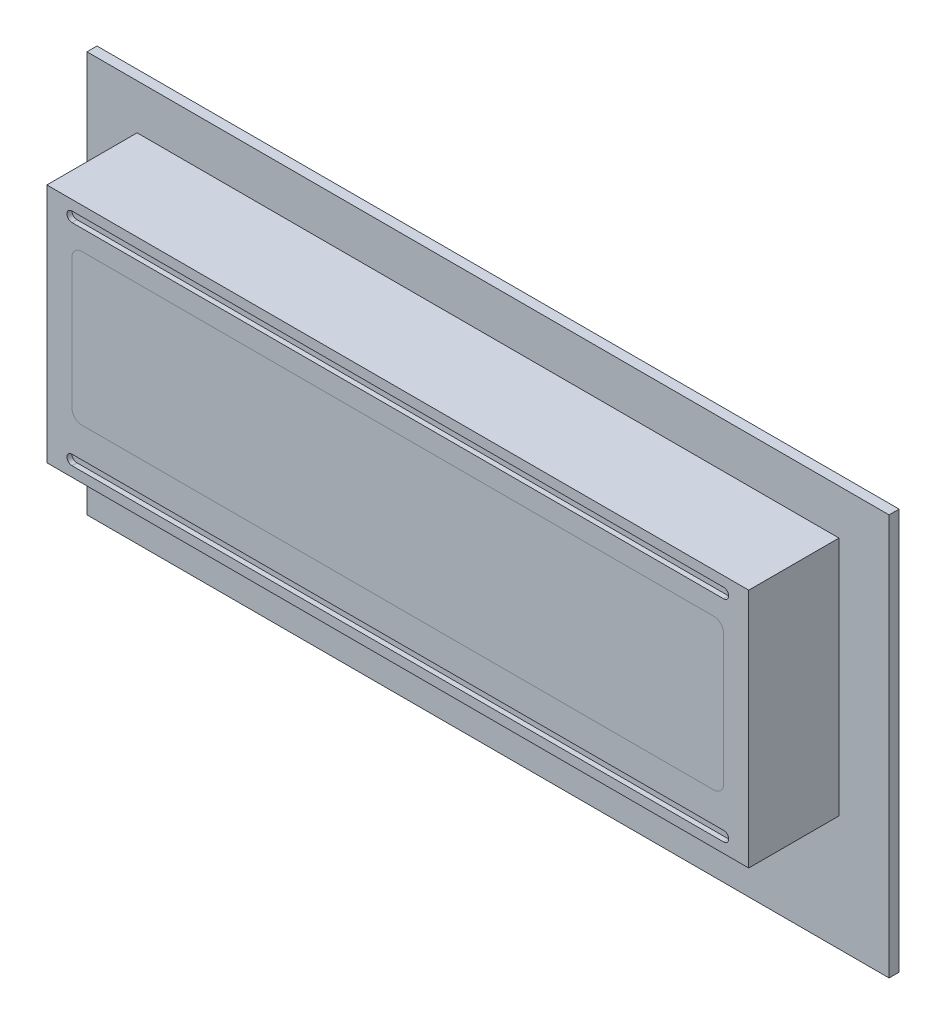
ISO-10303-21;
HEADER;
FILE_DESCRIPTION(('STEP AP214'),'2;1');
FILE_NAME('part.step','',(''),(''),'','','');
FILE_SCHEMA(('AUTOMOTIVE_DESIGN { 1 0 10303 214 1 1 1 1 }'));
ENDSEC;
DATA;
#1=APPLICATION_CONTEXT('core data for automotive mechanical design processes');
#2=APPLICATION_PROTOCOL_DEFINITION('international standard','automotive_design',2000,#1);
#3=PRODUCT_CONTEXT('',#1,'mechanical');
#4=PRODUCT('Part','Part','',(#3));
#5=PRODUCT_RELATED_PRODUCT_CATEGORY('part','',(#4));
#6=PRODUCT_DEFINITION_FORMATION('','',#4);
#7=PRODUCT_DEFINITION_CONTEXT('part definition',#1,'design');
#8=PRODUCT_DEFINITION('design','',#6,#7);
#9=PRODUCT_DEFINITION_SHAPE('','',#8);
#10=(LENGTH_UNIT() NAMED_UNIT(*) SI_UNIT(.MILLI.,.METRE.));
#11=(NAMED_UNIT(*) PLANE_ANGLE_UNIT() SI_UNIT($,.RADIAN.));
#12=(NAMED_UNIT(*) SI_UNIT($,.STERADIAN.) SOLID_ANGLE_UNIT());
#13=UNCERTAINTY_MEASURE_WITH_UNIT(LENGTH_MEASURE(1.E-05),#10,'distance_accuracy_value','');
#14=(GEOMETRIC_REPRESENTATION_CONTEXT(3) GLOBAL_UNCERTAINTY_ASSIGNED_CONTEXT((#13)) GLOBAL_UNIT_ASSIGNED_CONTEXT((#10,
#11,#12)) REPRESENTATION_CONTEXT('',''));
#15=CARTESIAN_POINT('',(0.,0.,0.));
#16=DIRECTION('',(0.,0.,1.));
#17=DIRECTION('',(1.,0.,0.));
#18=AXIS2_PLACEMENT_3D('',#15,#16,#17);
#19=CARTESIAN_POINT('',(-31.5,10.5,9.));
#20=DIRECTION('',(0.,0.,1.));
#21=DIRECTION('',(1.,0.,0.));
#22=AXIS2_PLACEMENT_3D('',#19,#20,#21);
#23=CYLINDRICAL_SURFACE('',#22,1.);
#24=CARTESIAN_POINT('',(-31.5,10.5,10.));
#25=DIRECTION('',(0.,0.,1.));
#26=DIRECTION('',(1.,0.,0.));
#27=AXIS2_PLACEMENT_3D('',#24,#25,#26);
#28=CIRCLE('',#27,1.);
#29=CARTESIAN_POINT('',(-31.5,11.5,10.));
#30=VERTEX_POINT('',#29);
#31=CARTESIAN_POINT('',(-32.5,10.5,10.));
#32=VERTEX_POINT('',#31);
#33=EDGE_CURVE('E141',#30,#32,#28,.T.);
#34=ORIENTED_EDGE('',*,*,#33,.F.);
#35=DIRECTION('',(0.,0.,1.));
#36=VECTOR('',#35,1.);
#37=CARTESIAN_POINT('',(-31.5,11.5,9.));
#38=LINE('',#37,#36);
#39=CARTESIAN_POINT('',(-31.5,11.5,9.));
#40=VERTEX_POINT('',#39);
#41=EDGE_CURVE('E12',#40,#30,#38,.T.);
#42=ORIENTED_EDGE('',*,*,#41,.F.);
#43=CARTESIAN_POINT('',(-31.5,10.5,9.));
#44=DIRECTION('',(0.,0.,1.));
#45=DIRECTION('',(1.,0.,0.));
#46=AXIS2_PLACEMENT_3D('',#43,#44,#45);
#47=CIRCLE('',#46,1.);
#48=CARTESIAN_POINT('',(-32.5,10.5,9.));
#49=VERTEX_POINT('',#48);
#50=EDGE_CURVE('E161',#40,#49,#47,.T.);
#51=ORIENTED_EDGE('',*,*,#50,.T.);
#52=DIRECTION('',(0.,0.,1.));
#53=VECTOR('',#52,1.);
#54=CARTESIAN_POINT('',(-32.5,10.5,9.));
#55=LINE('',#54,#53);
#56=EDGE_CURVE('E47',#49,#32,#55,.T.);
#57=ORIENTED_EDGE('',*,*,#56,.T.);
#58=EDGE_LOOP('',(#34,#42,#51,#57));
#59=FACE_BOUND('',#58,.T.);
#60=ADVANCED_FACE('F44',(#59),#23,.T.);
#61=CARTESIAN_POINT('',(31.5,11.5,9.));
#62=DIRECTION('',(0.,1.,0.));
#63=DIRECTION('',(0.,0.,1.));
#64=AXIS2_PLACEMENT_3D('',#61,#62,#63);
#65=PLANE('',#64);
#66=DIRECTION('',(-1.,0.,0.));
#67=VECTOR('',#66,1.);
#68=CARTESIAN_POINT('',(31.5,11.5,10.));
#69=LINE('',#68,#67);
#70=CARTESIAN_POINT('',(31.5,11.5,10.));
#71=VERTEX_POINT('',#70);
#72=EDGE_CURVE('E159',#71,#30,#69,.T.);
#73=ORIENTED_EDGE('',*,*,#72,.F.);
#74=DIRECTION('',(0.,0.,1.));
#75=VECTOR('',#74,1.);
#76=CARTESIAN_POINT('',(31.5,11.5,9.));
#77=LINE('',#76,#75);
#78=CARTESIAN_POINT('',(31.5,11.5,9.));
#79=VERTEX_POINT('',#78);
#80=EDGE_CURVE('E53',#79,#71,#77,.T.);
#81=ORIENTED_EDGE('',*,*,#80,.F.);
#82=DIRECTION('',(-1.,0.,0.));
#83=VECTOR('',#82,1.);
#84=CARTESIAN_POINT('',(31.5,11.5,9.));
#85=LINE('',#84,#83);
#86=EDGE_CURVE('E131',#79,#40,#85,.T.);
#87=ORIENTED_EDGE('',*,*,#86,.T.);
#88=ORIENTED_EDGE('',*,*,#41,.T.);
#89=EDGE_LOOP('',(#73,#81,#87,#88));
#90=FACE_BOUND('',#89,.T.);
#91=ADVANCED_FACE('F173',(#90),#65,.T.);
#92=CARTESIAN_POINT('',(31.5,10.5,9.));
#93=DIRECTION('',(0.,0.,1.));
#94=DIRECTION('',(1.,0.,0.));
#95=AXIS2_PLACEMENT_3D('',#92,#93,#94);
#96=CYLINDRICAL_SURFACE('',#95,1.);
#97=CARTESIAN_POINT('',(31.5,10.5,10.));
#98=DIRECTION('',(0.,0.,1.));
#99=DIRECTION('',(1.,0.,0.));
#100=AXIS2_PLACEMENT_3D('',#97,#98,#99);
#101=CIRCLE('',#100,1.);
#102=CARTESIAN_POINT('',(32.5,10.5,10.));
#103=VERTEX_POINT('',#102);
#104=EDGE_CURVE('E118',#103,#71,#101,.T.);
#105=ORIENTED_EDGE('',*,*,#104,.F.);
#106=DIRECTION('',(0.,0.,1.));
#107=VECTOR('',#106,1.);
#108=CARTESIAN_POINT('',(32.5,10.5,9.));
#109=LINE('',#108,#107);
#110=CARTESIAN_POINT('',(32.5,10.5,9.));
#111=VERTEX_POINT('',#110);
#112=EDGE_CURVE('E113',#111,#103,#109,.T.);
#113=ORIENTED_EDGE('',*,*,#112,.F.);
#114=CARTESIAN_POINT('',(31.5,10.5,9.));
#115=DIRECTION('',(0.,0.,1.));
#116=DIRECTION('',(1.,0.,0.));
#117=AXIS2_PLACEMENT_3D('',#114,#115,#116);
#118=CIRCLE('',#117,1.);
#119=EDGE_CURVE('E116',#111,#79,#118,.T.);
#120=ORIENTED_EDGE('',*,*,#119,.T.);
#121=ORIENTED_EDGE('',*,*,#80,.T.);
#122=EDGE_LOOP('',(#105,#113,#120,#121));
#123=FACE_BOUND('',#122,.T.);
#124=ADVANCED_FACE('F115',(#123),#96,.T.);
#125=CARTESIAN_POINT('',(32.5,-2.49999999999998,9.));
#126=DIRECTION('',(1.,0.,0.));
#127=DIRECTION('',(0.,0.,-1.));
#128=AXIS2_PLACEMENT_3D('',#125,#126,#127);
#129=PLANE('',#128);
#130=DIRECTION('',(0.,1.,0.));
#131=VECTOR('',#130,1.);
#132=CARTESIAN_POINT('',(32.5,-2.49999999999998,10.));
#133=LINE('',#132,#131);
#134=CARTESIAN_POINT('',(32.5,-2.49999999999998,10.));
#135=VERTEX_POINT('',#134);
#136=EDGE_CURVE('E156',#135,#103,#133,.T.);
#137=ORIENTED_EDGE('',*,*,#136,.F.);
#138=DIRECTION('',(0.,0.,1.));
#139=VECTOR('',#138,1.);
#140=CARTESIAN_POINT('',(32.5,-2.49999999999998,9.));
#141=LINE('',#140,#139);
#142=CARTESIAN_POINT('',(32.5,-2.49999999999998,9.));
#143=VERTEX_POINT('',#142);
#144=EDGE_CURVE('E123',#143,#135,#141,.T.);
#145=ORIENTED_EDGE('',*,*,#144,.F.);
#146=DIRECTION('',(0.,1.,0.));
#147=VECTOR('',#146,1.);
#148=CARTESIAN_POINT('',(32.5,-2.49999999999998,9.));
#149=LINE('',#148,#147);
#150=EDGE_CURVE('E129',#143,#111,#149,.T.);
#151=ORIENTED_EDGE('',*,*,#150,.T.);
#152=ORIENTED_EDGE('',*,*,#112,.T.);
#153=EDGE_LOOP('',(#137,#145,#151,#152));
#154=FACE_BOUND('',#153,.T.);
#155=ADVANCED_FACE('F133',(#154),#129,.T.);
#156=CARTESIAN_POINT('',(31.5,-2.49999999999999,9.));
#157=DIRECTION('',(0.,0.,1.));
#158=DIRECTION('',(1.,0.,0.));
#159=AXIS2_PLACEMENT_3D('',#156,#157,#158);
#160=CYLINDRICAL_SURFACE('',#159,1.);
#161=CARTESIAN_POINT('',(31.5,-2.49999999999999,10.));
#162=DIRECTION('',(0.,0.,1.));
#163=DIRECTION('',(1.,0.,0.));
#164=AXIS2_PLACEMENT_3D('',#161,#162,#163);
#165=CIRCLE('',#164,1.);
#166=CARTESIAN_POINT('',(31.5,-3.49999999999999,10.));
#167=VERTEX_POINT('',#166);
#168=EDGE_CURVE('E153',#167,#135,#165,.T.);
#169=ORIENTED_EDGE('',*,*,#168,.F.);
#170=DIRECTION('',(0.,0.,1.));
#171=VECTOR('',#170,1.);
#172=CARTESIAN_POINT('',(31.5,-3.49999999999999,9.));
#173=LINE('',#172,#171);
#174=CARTESIAN_POINT('',(31.5,-3.49999999999999,9.));
#175=VERTEX_POINT('',#174);
#176=EDGE_CURVE('E165',#175,#167,#173,.T.);
#177=ORIENTED_EDGE('',*,*,#176,.F.);
#178=CARTESIAN_POINT('',(31.5,-2.49999999999999,9.));
#179=DIRECTION('',(0.,0.,1.));
#180=DIRECTION('',(1.,0.,0.));
#181=AXIS2_PLACEMENT_3D('',#178,#179,#180);
#182=CIRCLE('',#181,1.);
#183=EDGE_CURVE('E134',#175,#143,#182,.T.);
#184=ORIENTED_EDGE('',*,*,#183,.T.);
#185=ORIENTED_EDGE('',*,*,#144,.T.);
#186=EDGE_LOOP('',(#169,#177,#184,#185));
#187=FACE_BOUND('',#186,.T.);
#188=ADVANCED_FACE('F186',(#187),#160,.T.);
#189=CARTESIAN_POINT('',(-31.5,-3.49999999999999,9.));
#190=DIRECTION('',(0.,-1.,0.));
#191=DIRECTION('',(0.,0.,-1.));
#192=AXIS2_PLACEMENT_3D('',#189,#190,#191);
#193=PLANE('',#192);
#194=DIRECTION('',(1.,0.,0.));
#195=VECTOR('',#194,1.);
#196=CARTESIAN_POINT('',(-31.5,-3.49999999999999,10.));
#197=LINE('',#196,#195);
#198=CARTESIAN_POINT('',(-31.5,-3.49999999999999,10.));
#199=VERTEX_POINT('',#198);
#200=EDGE_CURVE('E150',#199,#167,#197,.T.);
#201=ORIENTED_EDGE('',*,*,#200,.F.);
#202=DIRECTION('',(0.,0.,1.));
#203=VECTOR('',#202,1.);
#204=CARTESIAN_POINT('',(-31.5,-3.49999999999999,9.));
#205=LINE('',#204,#203);
#206=CARTESIAN_POINT('',(-31.5,-3.49999999999999,9.));
#207=VERTEX_POINT('',#206);
#208=EDGE_CURVE('E167',#207,#199,#205,.T.);
#209=ORIENTED_EDGE('',*,*,#208,.F.);
#210=DIRECTION('',(1.,0.,0.));
#211=VECTOR('',#210,1.);
#212=CARTESIAN_POINT('',(-31.5,-3.49999999999999,9.));
#213=LINE('',#212,#211);
#214=EDGE_CURVE('E136',#207,#175,#213,.T.);
#215=ORIENTED_EDGE('',*,*,#214,.T.);
#216=ORIENTED_EDGE('',*,*,#176,.T.);
#217=EDGE_LOOP('',(#201,#209,#215,#216));
#218=FACE_BOUND('',#217,.T.);
#219=ADVANCED_FACE('F189',(#218),#193,.T.);
#220=CARTESIAN_POINT('',(-31.5,-2.49999999999999,9.));
#221=DIRECTION('',(0.,0.,1.));
#222=DIRECTION('',(1.,0.,0.));
#223=AXIS2_PLACEMENT_3D('',#220,#221,#222);
#224=CYLINDRICAL_SURFACE('',#223,1.);
#225=CARTESIAN_POINT('',(-31.5,-2.49999999999999,10.));
#226=DIRECTION('',(0.,0.,1.));
#227=DIRECTION('',(1.,0.,0.));
#228=AXIS2_PLACEMENT_3D('',#225,#226,#227);
#229=CIRCLE('',#228,1.);
#230=CARTESIAN_POINT('',(-32.5,-2.49999999999998,10.));
#231=VERTEX_POINT('',#230);
#232=EDGE_CURVE('E147',#231,#199,#229,.T.);
#233=ORIENTED_EDGE('',*,*,#232,.F.);
#234=DIRECTION('',(0.,0.,1.));
#235=VECTOR('',#234,1.);
#236=CARTESIAN_POINT('',(-32.5,-2.49999999999998,9.));
#237=LINE('',#236,#235);
#238=CARTESIAN_POINT('',(-32.5,-2.49999999999998,9.));
#239=VERTEX_POINT('',#238);
#240=EDGE_CURVE('E168',#239,#231,#237,.T.);
#241=ORIENTED_EDGE('',*,*,#240,.F.);
#242=CARTESIAN_POINT('',(-31.5,-2.49999999999999,9.));
#243=DIRECTION('',(0.,0.,1.));
#244=DIRECTION('',(1.,0.,0.));
#245=AXIS2_PLACEMENT_3D('',#242,#243,#244);
#246=CIRCLE('',#245,1.);
#247=EDGE_CURVE('E264',#239,#207,#246,.T.);
#248=ORIENTED_EDGE('',*,*,#247,.T.);
#249=ORIENTED_EDGE('',*,*,#208,.T.);
#250=EDGE_LOOP('',(#233,#241,#248,#249));
#251=FACE_BOUND('',#250,.T.);
#252=ADVANCED_FACE('F193',(#251),#224,.T.);
#253=CARTESIAN_POINT('',(-32.5,10.5,9.));
#254=DIRECTION('',(-1.,0.,0.));
#255=DIRECTION('',(0.,0.,1.));
#256=AXIS2_PLACEMENT_3D('',#253,#254,#255);
#257=PLANE('',#256);
#258=DIRECTION('',(0.,-1.,0.));
#259=VECTOR('',#258,1.);
#260=CARTESIAN_POINT('',(-32.5,10.5,10.));
#261=LINE('',#260,#259);
#262=EDGE_CURVE('E144',#32,#231,#261,.T.);
#263=ORIENTED_EDGE('',*,*,#262,.F.);
#264=ORIENTED_EDGE('',*,*,#56,.F.);
#265=DIRECTION('',(0.,-1.,0.));
#266=VECTOR('',#265,1.);
#267=CARTESIAN_POINT('',(-32.5,10.5,9.));
#268=LINE('',#267,#266);
#269=EDGE_CURVE('E265',#49,#239,#268,.T.);
#270=ORIENTED_EDGE('',*,*,#269,.T.);
#271=ORIENTED_EDGE('',*,*,#240,.T.);
#272=EDGE_LOOP('',(#263,#264,#270,#271));
#273=FACE_BOUND('',#272,.T.);
#274=ADVANCED_FACE('F170',(#273),#257,.T.);
#275=CARTESIAN_POINT('',(-31.5,10.5,9.));
#276=DIRECTION('',(0.,0.,1.));
#277=DIRECTION('',(1.,0.,0.));
#278=AXIS2_PLACEMENT_3D('',#275,#276,#277);
#279=PLANE('',#278);
#280=ORIENTED_EDGE('',*,*,#50,.F.);
#281=ORIENTED_EDGE('',*,*,#86,.F.);
#282=ORIENTED_EDGE('',*,*,#119,.F.);
#283=ORIENTED_EDGE('',*,*,#150,.F.);
#284=ORIENTED_EDGE('',*,*,#183,.F.);
#285=ORIENTED_EDGE('',*,*,#214,.F.);
#286=ORIENTED_EDGE('',*,*,#247,.F.);
#287=ORIENTED_EDGE('',*,*,#269,.F.);
#288=EDGE_LOOP('',(#280,#281,#282,#283,#284,#285,#286,#287));
#289=FACE_BOUND('',#288,.T.);
#290=ADVANCED_FACE('F127',(#289),#279,.F.);
#291=CARTESIAN_POINT('',(-31.5,10.5,10.));
#292=DIRECTION('',(0.,0.,1.));
#293=DIRECTION('',(1.,0.,0.));
#294=AXIS2_PLACEMENT_3D('',#291,#292,#293);
#295=PLANE('',#294);
#296=ORIENTED_EDGE('',*,*,#33,.T.);
#297=ORIENTED_EDGE('',*,*,#262,.T.);
#298=ORIENTED_EDGE('',*,*,#232,.T.);
#299=ORIENTED_EDGE('',*,*,#200,.T.);
#300=ORIENTED_EDGE('',*,*,#168,.T.);
#301=ORIENTED_EDGE('',*,*,#136,.T.);
#302=ORIENTED_EDGE('',*,*,#104,.T.);
#303=ORIENTED_EDGE('',*,*,#72,.T.);
#304=EDGE_LOOP('',(#296,#297,#298,#299,#300,#301,#302,#303));
#305=FACE_BOUND('',#304,.T.);
#306=ADVANCED_FACE('F172',(#305),#295,.T.);
#307=CLOSED_SHELL('',(#60,#91,#124,#155,#188,#219,#252,#274,#290,#306));
#308=MANIFOLD_SOLID_BREP('B2',#307);
#309=CARTESIAN_POINT('',(0.,0.,1.));
#310=DIRECTION('',(0.,0.,1.));
#311=DIRECTION('',(1.,0.,0.));
#312=AXIS2_PLACEMENT_3D('',#309,#310,#311);
#313=PLANE('',#312);
#314=DIRECTION('',(0.,-1.,0.));
#315=VECTOR('',#314,1.);
#316=CARTESIAN_POINT('',(-40.,20.,1.));
#317=LINE('',#316,#315);
#318=CARTESIAN_POINT('',(-40.,20.,1.));
#319=VERTEX_POINT('',#318);
#320=CARTESIAN_POINT('',(-40.,-20.,1.));
#321=VERTEX_POINT('',#320);
#322=EDGE_CURVE('E587',#319,#321,#317,.T.);
#323=ORIENTED_EDGE('',*,*,#322,.T.);
#324=DIRECTION('',(1.,0.,0.));
#325=VECTOR('',#324,1.);
#326=CARTESIAN_POINT('',(-40.,-20.,1.));
#327=LINE('',#326,#325);
#328=CARTESIAN_POINT('',(40.,-20.,1.));
#329=VERTEX_POINT('',#328);
#330=EDGE_CURVE('E590',#321,#329,#327,.T.);
#331=ORIENTED_EDGE('',*,*,#330,.T.);
#332=DIRECTION('',(0.,1.,0.));
#333=VECTOR('',#332,1.);
#334=CARTESIAN_POINT('',(40.,20.,1.));
#335=LINE('',#334,#333);
#336=CARTESIAN_POINT('',(40.,20.,1.));
#337=VERTEX_POINT('',#336);
#338=EDGE_CURVE('E593',#329,#337,#335,.T.);
#339=ORIENTED_EDGE('',*,*,#338,.T.);
#340=DIRECTION('',(-1.,0.,0.));
#341=VECTOR('',#340,1.);
#342=CARTESIAN_POINT('',(-40.,20.,1.));
#343=LINE('',#342,#341);
#344=EDGE_CURVE('E595',#337,#319,#343,.T.);
#345=ORIENTED_EDGE('',*,*,#344,.T.);
#346=EDGE_LOOP('',(#323,#331,#339,#345));
#347=FACE_BOUND('',#346,.T.);
#348=DIRECTION('',(1.,0.,0.));
#349=VECTOR('',#348,1.);
#350=CARTESIAN_POINT('',(-35.,-8.49999999999999,1.));
#351=LINE('',#350,#349);
#352=CARTESIAN_POINT('',(-35.,-8.49999999999999,1.));
#353=VERTEX_POINT('',#352);
#354=CARTESIAN_POINT('',(35.,-8.49999999999999,1.));
#355=VERTEX_POINT('',#354);
#356=EDGE_CURVE('E571',#353,#355,#351,.T.);
#357=ORIENTED_EDGE('',*,*,#356,.F.);
#358=DIRECTION('',(0.,-1.,0.));
#359=VECTOR('',#358,1.);
#360=CARTESIAN_POINT('',(-35.,15.5,1.));
#361=LINE('',#360,#359);
#362=CARTESIAN_POINT('',(-35.,15.5,1.));
#363=VERTEX_POINT('',#362);
#364=EDGE_CURVE('E557',#363,#353,#361,.T.);
#365=ORIENTED_EDGE('',*,*,#364,.F.);
#366=DIRECTION('',(-1.,0.,0.));
#367=VECTOR('',#366,1.);
#368=CARTESIAN_POINT('',(-35.,15.5,1.));
#369=LINE('',#368,#367);
#370=CARTESIAN_POINT('',(35.,15.5,1.));
#371=VERTEX_POINT('',#370);
#372=EDGE_CURVE('E562',#371,#363,#369,.T.);
#373=ORIENTED_EDGE('',*,*,#372,.F.);
#374=DIRECTION('',(0.,1.,0.));
#375=VECTOR('',#374,1.);
#376=CARTESIAN_POINT('',(35.,15.5,1.));
#377=LINE('',#376,#375);
#378=EDGE_CURVE('E573',#355,#371,#377,.T.);
#379=ORIENTED_EDGE('',*,*,#378,.F.);
#380=EDGE_LOOP('',(#357,#365,#373,#379));
#381=FACE_BOUND('',#380,.T.);
#382=ADVANCED_FACE('F271',(#347,#381),#313,.T.);
#383=CARTESIAN_POINT('',(-40.,20.,1.));
#384=DIRECTION('',(1.,0.,0.));
#385=DIRECTION('',(0.,0.,-1.));
#386=AXIS2_PLACEMENT_3D('',#383,#384,#385);
#387=PLANE('',#386);
#388=DIRECTION('',(0.,-1.,0.));
#389=VECTOR('',#388,1.);
#390=CARTESIAN_POINT('',(-40.,20.,0.));
#391=LINE('',#390,#389);
#392=CARTESIAN_POINT('',(-40.,20.,0.));
#393=VERTEX_POINT('',#392);
#394=CARTESIAN_POINT('',(-40.,-20.,0.));
#395=VERTEX_POINT('',#394);
#396=EDGE_CURVE('E586',#393,#395,#391,.T.);
#397=ORIENTED_EDGE('',*,*,#396,.T.);
#398=DIRECTION('',(0.,0.,-1.));
#399=VECTOR('',#398,1.);
#400=CARTESIAN_POINT('',(-40.,-20.,1.));
#401=LINE('',#400,#399);
#402=EDGE_CURVE('E42',#321,#395,#401,.T.);
#403=ORIENTED_EDGE('',*,*,#402,.F.);
#404=ORIENTED_EDGE('',*,*,#322,.F.);
#405=DIRECTION('',(0.,0.,-1.));
#406=VECTOR('',#405,1.);
#407=CARTESIAN_POINT('',(-40.,20.,1.));
#408=LINE('',#407,#406);
#409=EDGE_CURVE('E597',#319,#393,#408,.T.);
#410=ORIENTED_EDGE('',*,*,#409,.T.);
#411=EDGE_LOOP('',(#397,#403,#404,#410));
#412=FACE_BOUND('',#411,.T.);
#413=ADVANCED_FACE('F273',(#412),#387,.F.);
#414=CARTESIAN_POINT('',(-40.,-20.,1.));
#415=DIRECTION('',(0.,1.,0.));
#416=DIRECTION('',(-1.,0.,0.));
#417=AXIS2_PLACEMENT_3D('',#414,#415,#416);
#418=PLANE('',#417);
#419=DIRECTION('',(1.,0.,0.));
#420=VECTOR('',#419,1.);
#421=CARTESIAN_POINT('',(-40.,-20.,0.));
#422=LINE('',#421,#420);
#423=CARTESIAN_POINT('',(40.,-20.,0.));
#424=VERTEX_POINT('',#423);
#425=EDGE_CURVE('E600',#395,#424,#422,.T.);
#426=ORIENTED_EDGE('',*,*,#425,.T.);
#427=DIRECTION('',(0.,0.,-1.));
#428=VECTOR('',#427,1.);
#429=CARTESIAN_POINT('',(40.,-20.,1.));
#430=LINE('',#429,#428);
#431=EDGE_CURVE('E279',#329,#424,#430,.T.);
#432=ORIENTED_EDGE('',*,*,#431,.F.);
#433=ORIENTED_EDGE('',*,*,#330,.F.);
#434=ORIENTED_EDGE('',*,*,#402,.T.);
#435=EDGE_LOOP('',(#426,#432,#433,#434));
#436=FACE_BOUND('',#435,.T.);
#437=ADVANCED_FACE('F630',(#436),#418,.F.);
#438=CARTESIAN_POINT('',(40.,20.,1.));
#439=DIRECTION('',(-1.,0.,0.));
#440=DIRECTION('',(0.,-1.,0.));
#441=AXIS2_PLACEMENT_3D('',#438,#439,#440);
#442=PLANE('',#441);
#443=DIRECTION('',(0.,1.,0.));
#444=VECTOR('',#443,1.);
#445=CARTESIAN_POINT('',(40.,20.,0.));
#446=LINE('',#445,#444);
#447=CARTESIAN_POINT('',(40.,20.,0.));
#448=VERTEX_POINT('',#447);
#449=EDGE_CURVE('E602',#424,#448,#446,.T.);
#450=ORIENTED_EDGE('',*,*,#449,.T.);
#451=DIRECTION('',(0.,0.,-1.));
#452=VECTOR('',#451,1.);
#453=CARTESIAN_POINT('',(40.,20.,1.));
#454=LINE('',#453,#452);
#455=EDGE_CURVE('E607',#337,#448,#454,.T.);
#456=ORIENTED_EDGE('',*,*,#455,.F.);
#457=ORIENTED_EDGE('',*,*,#338,.F.);
#458=ORIENTED_EDGE('',*,*,#431,.T.);
#459=EDGE_LOOP('',(#450,#456,#457,#458));
#460=FACE_BOUND('',#459,.T.);
#461=ADVANCED_FACE('F614',(#460),#442,.F.);
#462=CARTESIAN_POINT('',(-40.,20.,1.));
#463=DIRECTION('',(0.,-1.,0.));
#464=DIRECTION('',(1.,0.,0.));
#465=AXIS2_PLACEMENT_3D('',#462,#463,#464);
#466=PLANE('',#465);
#467=DIRECTION('',(-1.,0.,0.));
#468=VECTOR('',#467,1.);
#469=CARTESIAN_POINT('',(-40.,20.,0.));
#470=LINE('',#469,#468);
#471=EDGE_CURVE('E591',#448,#393,#470,.T.);
#472=ORIENTED_EDGE('',*,*,#471,.T.);
#473=ORIENTED_EDGE('',*,*,#409,.F.);
#474=ORIENTED_EDGE('',*,*,#344,.F.);
#475=ORIENTED_EDGE('',*,*,#455,.T.);
#476=EDGE_LOOP('',(#472,#473,#474,#475));
#477=FACE_BOUND('',#476,.T.);
#478=ADVANCED_FACE('F623',(#477),#466,.F.);
#479=CARTESIAN_POINT('',(0.,0.,0.));
#480=DIRECTION('',(0.,0.,1.));
#481=DIRECTION('',(1.,0.,0.));
#482=AXIS2_PLACEMENT_3D('',#479,#480,#481);
#483=PLANE('',#482);
#484=ORIENTED_EDGE('',*,*,#396,.F.);
#485=ORIENTED_EDGE('',*,*,#471,.F.);
#486=ORIENTED_EDGE('',*,*,#449,.F.);
#487=ORIENTED_EDGE('',*,*,#425,.F.);
#488=EDGE_LOOP('',(#484,#485,#486,#487));
#489=FACE_BOUND('',#488,.T.);
#490=ADVANCED_FACE('F620',(#489),#483,.F.);
#491=CARTESIAN_POINT('',(0.,0.,10.));
#492=DIRECTION('',(0.,0.,1.));
#493=DIRECTION('',(1.,0.,0.));
#494=AXIS2_PLACEMENT_3D('',#491,#492,#493);
#495=PLANE('',#494);
#496=CARTESIAN_POINT('',(32.5,-6.99999999999999,10.));
#497=DIRECTION('',(0.,0.,1.));
#498=DIRECTION('',(-1.,0.,0.));
#499=AXIS2_PLACEMENT_3D('',#496,#497,#498);
#500=CIRCLE('',#499,0.499999999999988);
#501=CARTESIAN_POINT('',(32.5,-7.49999999999999,10.));
#502=VERTEX_POINT('',#501);
#503=CARTESIAN_POINT('',(32.5,-6.50000000000001,10.));
#504=VERTEX_POINT('',#503);
#505=EDGE_CURVE('E286',#502,#504,#500,.T.);
#506=ORIENTED_EDGE('',*,*,#505,.F.);
#507=DIRECTION('',(1.,0.,0.));
#508=VECTOR('',#507,1.);
#509=CARTESIAN_POINT('',(-32.5,-7.49999999999999,10.));
#510=LINE('',#509,#508);
#511=CARTESIAN_POINT('',(-32.5,-7.49999999999999,10.));
#512=VERTEX_POINT('',#511);
#513=EDGE_CURVE('E452',#512,#502,#510,.T.);
#514=ORIENTED_EDGE('',*,*,#513,.F.);
#515=CARTESIAN_POINT('',(-32.5,-6.99999999999999,10.));
#516=DIRECTION('',(0.,0.,1.));
#517=DIRECTION('',(-1.,0.,0.));
#518=AXIS2_PLACEMENT_3D('',#515,#516,#517);
#519=CIRCLE('',#518,0.5);
#520=CARTESIAN_POINT('',(-32.5,-6.49999999999999,10.));
#521=VERTEX_POINT('',#520);
#522=EDGE_CURVE('E455',#521,#512,#519,.T.);
#523=ORIENTED_EDGE('',*,*,#522,.F.);
#524=DIRECTION('',(-1.,0.,0.));
#525=VECTOR('',#524,1.);
#526=CARTESIAN_POINT('',(-32.5,-6.49999999999999,10.));
#527=LINE('',#526,#525);
#528=EDGE_CURVE('E461',#504,#521,#527,.T.);
#529=ORIENTED_EDGE('',*,*,#528,.F.);
#530=EDGE_LOOP('',(#506,#514,#523,#529));
#531=FACE_BOUND('',#530,.T.);
#532=CARTESIAN_POINT('',(-32.5,14.,10.));
#533=DIRECTION('',(0.,0.,1.));
#534=DIRECTION('',(1.,0.,0.));
#535=AXIS2_PLACEMENT_3D('',#532,#533,#534);
#536=CIRCLE('',#535,0.5);
#537=CARTESIAN_POINT('',(-32.5,14.5,10.));
#538=VERTEX_POINT('',#537);
#539=CARTESIAN_POINT('',(-32.5,13.5,10.));
#540=VERTEX_POINT('',#539);
#541=EDGE_CURVE('E294',#538,#540,#536,.T.);
#542=ORIENTED_EDGE('',*,*,#541,.F.);
#543=DIRECTION('',(-1.,0.,0.));
#544=VECTOR('',#543,1.);
#545=CARTESIAN_POINT('',(-32.5,14.5,10.));
#546=LINE('',#545,#544);
#547=CARTESIAN_POINT('',(32.5,14.5,10.));
#548=VERTEX_POINT('',#547);
#549=EDGE_CURVE('E474',#548,#538,#546,.T.);
#550=ORIENTED_EDGE('',*,*,#549,.F.);
#551=CARTESIAN_POINT('',(32.5,14.,10.));
#552=DIRECTION('',(0.,0.,1.));
#553=DIRECTION('',(1.,0.,0.));
#554=AXIS2_PLACEMENT_3D('',#551,#552,#553);
#555=CIRCLE('',#554,0.499999999999988);
#556=CARTESIAN_POINT('',(32.5,13.5,10.));
#557=VERTEX_POINT('',#556);
#558=EDGE_CURVE('E488',#557,#548,#555,.T.);
#559=ORIENTED_EDGE('',*,*,#558,.F.);
#560=DIRECTION('',(1.,0.,0.));
#561=VECTOR('',#560,1.);
#562=CARTESIAN_POINT('',(-32.5,13.5,10.));
#563=LINE('',#562,#561);
#564=EDGE_CURVE('E485',#540,#557,#563,.T.);
#565=ORIENTED_EDGE('',*,*,#564,.F.);
#566=EDGE_LOOP('',(#542,#550,#559,#565));
#567=FACE_BOUND('',#566,.T.);
#568=DIRECTION('',(0.,-1.,0.));
#569=VECTOR('',#568,1.);
#570=CARTESIAN_POINT('',(-35.,15.5,10.));
#571=LINE('',#570,#569);
#572=CARTESIAN_POINT('',(-35.,15.5,10.));
#573=VERTEX_POINT('',#572);
#574=CARTESIAN_POINT('',(-35.,-8.49999999999999,10.));
#575=VERTEX_POINT('',#574);
#576=EDGE_CURVE('E558',#573,#575,#571,.T.);
#577=ORIENTED_EDGE('',*,*,#576,.T.);
#578=DIRECTION('',(1.,0.,0.));
#579=VECTOR('',#578,1.);
#580=CARTESIAN_POINT('',(-35.,-8.49999999999999,10.));
#581=LINE('',#580,#579);
#582=CARTESIAN_POINT('',(35.,-8.49999999999999,10.));
#583=VERTEX_POINT('',#582);
#584=EDGE_CURVE('E561',#575,#583,#581,.T.);
#585=ORIENTED_EDGE('',*,*,#584,.T.);
#586=DIRECTION('',(0.,1.,0.));
#587=VECTOR('',#586,1.);
#588=CARTESIAN_POINT('',(35.,15.5,10.));
#589=LINE('',#588,#587);
#590=CARTESIAN_POINT('',(35.,15.5,10.));
#591=VERTEX_POINT('',#590);
#592=EDGE_CURVE('E564',#583,#591,#589,.T.);
#593=ORIENTED_EDGE('',*,*,#592,.T.);
#594=DIRECTION('',(-1.,0.,0.));
#595=VECTOR('',#594,1.);
#596=CARTESIAN_POINT('',(-35.,15.5,10.));
#597=LINE('',#596,#595);
#598=EDGE_CURVE('E566',#591,#573,#597,.T.);
#599=ORIENTED_EDGE('',*,*,#598,.T.);
#600=EDGE_LOOP('',(#577,#585,#593,#599));
#601=FACE_BOUND('',#600,.T.);
#602=DIRECTION('',(0.,1.,0.));
#603=VECTOR('',#602,1.);
#604=CARTESIAN_POINT('',(32.5,10.5,10.));
#605=LINE('',#604,#603);
#606=CARTESIAN_POINT('',(32.5,-2.49999999999998,10.));
#607=VERTEX_POINT('',#606);
#608=CARTESIAN_POINT('',(32.5,10.5,10.));
#609=VERTEX_POINT('',#608);
#610=EDGE_CURVE('E503',#607,#609,#605,.T.);
#611=ORIENTED_EDGE('',*,*,#610,.F.);
#612=CARTESIAN_POINT('',(31.5,-2.49999999999999,10.));
#613=DIRECTION('',(0.,0.,1.));
#614=DIRECTION('',(1.,0.,0.));
#615=AXIS2_PLACEMENT_3D('',#612,#613,#614);
#616=CIRCLE('',#615,1.);
#617=CARTESIAN_POINT('',(31.5,-3.49999999999999,10.));
#618=VERTEX_POINT('',#617);
#619=EDGE_CURVE('E501',#618,#607,#616,.T.);
#620=ORIENTED_EDGE('',*,*,#619,.F.);
#621=DIRECTION('',(1.,0.,0.));
#622=VECTOR('',#621,1.);
#623=CARTESIAN_POINT('',(-31.5,-3.49999999999999,10.));
#624=LINE('',#623,#622);
#625=CARTESIAN_POINT('',(-31.5,-3.49999999999999,10.));
#626=VERTEX_POINT('',#625);
#627=EDGE_CURVE('E517',#626,#618,#624,.T.);
#628=ORIENTED_EDGE('',*,*,#627,.F.);
#629=CARTESIAN_POINT('',(-31.5,-2.49999999999999,10.));
#630=DIRECTION('',(0.,0.,1.));
#631=DIRECTION('',(1.,0.,0.));
#632=AXIS2_PLACEMENT_3D('',#629,#630,#631);
#633=CIRCLE('',#632,1.);
#634=CARTESIAN_POINT('',(-32.5,-2.49999999999998,10.));
#635=VERTEX_POINT('',#634);
#636=EDGE_CURVE('E514',#635,#626,#633,.T.);
#637=ORIENTED_EDGE('',*,*,#636,.F.);
#638=DIRECTION('',(0.,-1.,0.));
#639=VECTOR('',#638,1.);
#640=CARTESIAN_POINT('',(-32.5,10.5,10.));
#641=LINE('',#640,#639);
#642=CARTESIAN_POINT('',(-32.5,10.5,10.));
#643=VERTEX_POINT('',#642);
#644=EDGE_CURVE('E512',#643,#635,#641,.T.);
#645=ORIENTED_EDGE('',*,*,#644,.F.);
#646=CARTESIAN_POINT('',(-31.5,10.5,10.));
#647=DIRECTION('',(0.,0.,1.));
#648=DIRECTION('',(1.,0.,0.));
#649=AXIS2_PLACEMENT_3D('',#646,#647,#648);
#650=CIRCLE('',#649,1.);
#651=CARTESIAN_POINT('',(-31.5,11.5,10.));
#652=VERTEX_POINT('',#651);
#653=EDGE_CURVE('E510',#652,#643,#650,.T.);
#654=ORIENTED_EDGE('',*,*,#653,.F.);
#655=DIRECTION('',(-1.,0.,0.));
#656=VECTOR('',#655,1.);
#657=CARTESIAN_POINT('',(-31.5,11.5,10.));
#658=LINE('',#657,#656);
#659=CARTESIAN_POINT('',(31.5,11.5,10.));
#660=VERTEX_POINT('',#659);
#661=EDGE_CURVE('E508',#660,#652,#658,.T.);
#662=ORIENTED_EDGE('',*,*,#661,.F.);
#663=CARTESIAN_POINT('',(31.5,10.5,10.));
#664=DIRECTION('',(0.,0.,1.));
#665=DIRECTION('',(-1.,0.,0.));
#666=AXIS2_PLACEMENT_3D('',#663,#664,#665);
#667=CIRCLE('',#666,1.);
#668=EDGE_CURVE('E506',#609,#660,#667,.T.);
#669=ORIENTED_EDGE('',*,*,#668,.F.);
#670=EDGE_LOOP('',(#611,#620,#628,#637,#645,#654,#662,#669));
#671=FACE_BOUND('',#670,.T.);
#672=ADVANCED_FACE('F672',(#531,#567,#601,#671),#495,.T.);
#673=CARTESIAN_POINT('',(-35.,15.5,10.));
#674=DIRECTION('',(1.,0.,0.));
#675=DIRECTION('',(0.,0.,-1.));
#676=AXIS2_PLACEMENT_3D('',#673,#674,#675);
#677=PLANE('',#676);
#678=ORIENTED_EDGE('',*,*,#364,.T.);
#679=DIRECTION('',(0.,0.,-1.));
#680=VECTOR('',#679,1.);
#681=CARTESIAN_POINT('',(-35.,-8.49999999999999,10.));
#682=LINE('',#681,#680);
#683=EDGE_CURVE('E584',#575,#353,#682,.T.);
#684=ORIENTED_EDGE('',*,*,#683,.F.);
#685=ORIENTED_EDGE('',*,*,#576,.F.);
#686=DIRECTION('',(0.,0.,-1.));
#687=VECTOR('',#686,1.);
#688=CARTESIAN_POINT('',(-35.,15.5,10.));
#689=LINE('',#688,#687);
#690=EDGE_CURVE('E568',#573,#363,#689,.T.);
#691=ORIENTED_EDGE('',*,*,#690,.T.);
#692=EDGE_LOOP('',(#678,#684,#685,#691));
#693=FACE_BOUND('',#692,.T.);
#694=ADVANCED_FACE('F715',(#693),#677,.F.);
#695=CARTESIAN_POINT('',(-35.,-8.49999999999999,10.));
#696=DIRECTION('',(0.,1.,0.));
#697=DIRECTION('',(0.,0.,1.));
#698=AXIS2_PLACEMENT_3D('',#695,#696,#697);
#699=PLANE('',#698);
#700=ORIENTED_EDGE('',*,*,#356,.T.);
#701=DIRECTION('',(0.,0.,-1.));
#702=VECTOR('',#701,1.);
#703=CARTESIAN_POINT('',(35.,-8.49999999999999,10.));
#704=LINE('',#703,#702);
#705=EDGE_CURVE('E581',#583,#355,#704,.T.);
#706=ORIENTED_EDGE('',*,*,#705,.F.);
#707=ORIENTED_EDGE('',*,*,#584,.F.);
#708=ORIENTED_EDGE('',*,*,#683,.T.);
#709=EDGE_LOOP('',(#700,#706,#707,#708));
#710=FACE_BOUND('',#709,.T.);
#711=ADVANCED_FACE('F723',(#710),#699,.F.);
#712=CARTESIAN_POINT('',(35.,15.5,10.));
#713=DIRECTION('',(-1.,0.,0.));
#714=DIRECTION('',(0.,0.,1.));
#715=AXIS2_PLACEMENT_3D('',#712,#713,#714);
#716=PLANE('',#715);
#717=ORIENTED_EDGE('',*,*,#378,.T.);
#718=DIRECTION('',(0.,0.,-1.));
#719=VECTOR('',#718,1.);
#720=CARTESIAN_POINT('',(35.,15.5,10.));
#721=LINE('',#720,#719);
#722=EDGE_CURVE('E579',#591,#371,#721,.T.);
#723=ORIENTED_EDGE('',*,*,#722,.F.);
#724=ORIENTED_EDGE('',*,*,#592,.F.);
#725=ORIENTED_EDGE('',*,*,#705,.T.);
#726=EDGE_LOOP('',(#717,#723,#724,#725));
#727=FACE_BOUND('',#726,.T.);
#728=ADVANCED_FACE('F719',(#727),#716,.F.);
#729=CARTESIAN_POINT('',(-35.,15.5,10.));
#730=DIRECTION('',(0.,-1.,0.));
#731=DIRECTION('',(0.,0.,-1.));
#732=AXIS2_PLACEMENT_3D('',#729,#730,#731);
#733=PLANE('',#732);
#734=ORIENTED_EDGE('',*,*,#372,.T.);
#735=ORIENTED_EDGE('',*,*,#690,.F.);
#736=ORIENTED_EDGE('',*,*,#598,.F.);
#737=ORIENTED_EDGE('',*,*,#722,.T.);
#738=EDGE_LOOP('',(#734,#735,#736,#737));
#739=FACE_BOUND('',#738,.T.);
#740=ADVANCED_FACE('F712',(#739),#733,.F.);
#741=CARTESIAN_POINT('',(31.5,-2.49999999999999,10.));
#742=DIRECTION('',(0.,0.,-1.));
#743=DIRECTION('',(-1.,0.,0.));
#744=AXIS2_PLACEMENT_3D('',#741,#742,#743);
#745=CYLINDRICAL_SURFACE('',#744,1.);
#746=CARTESIAN_POINT('',(31.5,-2.49999999999999,1.));
#747=DIRECTION('',(0.,0.,1.));
#748=DIRECTION('',(1.,0.,0.));
#749=AXIS2_PLACEMENT_3D('',#746,#747,#748);
#750=CIRCLE('',#749,1.);
#751=CARTESIAN_POINT('',(31.5,-3.49999999999999,1.));
#752=VERTEX_POINT('',#751);
#753=CARTESIAN_POINT('',(32.5,-2.49999999999998,1.));
#754=VERTEX_POINT('',#753);
#755=EDGE_CURVE('E495',#752,#754,#750,.T.);
#756=ORIENTED_EDGE('',*,*,#755,.F.);
#757=DIRECTION('',(0.,0.,-1.));
#758=VECTOR('',#757,1.);
#759=CARTESIAN_POINT('',(31.5,-3.49999999999999,10.));
#760=LINE('',#759,#758);
#761=EDGE_CURVE('E519',#618,#752,#760,.T.);
#762=ORIENTED_EDGE('',*,*,#761,.F.);
#763=ORIENTED_EDGE('',*,*,#619,.T.);
#764=DIRECTION('',(0.,0.,-1.));
#765=VECTOR('',#764,1.);
#766=CARTESIAN_POINT('',(32.5,-2.49999999999998,10.));
#767=LINE('',#766,#765);
#768=EDGE_CURVE('E554',#607,#754,#767,.T.);
#769=ORIENTED_EDGE('',*,*,#768,.T.);
#770=EDGE_LOOP('',(#756,#762,#763,#769));
#771=FACE_BOUND('',#770,.T.);
#772=ADVANCED_FACE('F668',(#771),#745,.F.);
#773=CARTESIAN_POINT('',(32.5,10.5,10.));
#774=DIRECTION('',(-1.,0.,0.));
#775=DIRECTION('',(0.,0.,1.));
#776=AXIS2_PLACEMENT_3D('',#773,#774,#775);
#777=PLANE('',#776);
#778=DIRECTION('',(0.,1.,0.));
#779=VECTOR('',#778,1.);
#780=CARTESIAN_POINT('',(32.5,10.5,1.));
#781=LINE('',#780,#779);
#782=CARTESIAN_POINT('',(32.5,10.5,1.));
#783=VERTEX_POINT('',#782);
#784=EDGE_CURVE('E521',#754,#783,#781,.T.);
#785=ORIENTED_EDGE('',*,*,#784,.F.);
#786=ORIENTED_EDGE('',*,*,#768,.F.);
#787=ORIENTED_EDGE('',*,*,#610,.T.);
#788=DIRECTION('',(0.,0.,-1.));
#789=VECTOR('',#788,1.);
#790=CARTESIAN_POINT('',(32.5,10.5,10.));
#791=LINE('',#790,#789);
#792=EDGE_CURVE('E551',#609,#783,#791,.T.);
#793=ORIENTED_EDGE('',*,*,#792,.T.);
#794=EDGE_LOOP('',(#785,#786,#787,#793));
#795=FACE_BOUND('',#794,.T.);
#796=ADVANCED_FACE('F664',(#795),#777,.T.);
#797=CARTESIAN_POINT('',(31.5,10.5,10.));
#798=DIRECTION('',(0.,0.,-1.));
#799=DIRECTION('',(-1.,0.,0.));
#800=AXIS2_PLACEMENT_3D('',#797,#798,#799);
#801=CYLINDRICAL_SURFACE('',#800,1.);
#802=CARTESIAN_POINT('',(31.5,10.5,1.));
#803=DIRECTION('',(0.,0.,1.));
#804=DIRECTION('',(-1.,0.,0.));
#805=AXIS2_PLACEMENT_3D('',#802,#803,#804);
#806=CIRCLE('',#805,1.);
#807=CARTESIAN_POINT('',(31.5,11.5,1.));
#808=VERTEX_POINT('',#807);
#809=EDGE_CURVE('E523',#783,#808,#806,.T.);
#810=ORIENTED_EDGE('',*,*,#809,.F.);
#811=ORIENTED_EDGE('',*,*,#792,.F.);
#812=ORIENTED_EDGE('',*,*,#668,.T.);
#813=DIRECTION('',(0.,0.,-1.));
#814=VECTOR('',#813,1.);
#815=CARTESIAN_POINT('',(31.5,11.5,10.));
#816=LINE('',#815,#814);
#817=EDGE_CURVE('E548',#660,#808,#816,.T.);
#818=ORIENTED_EDGE('',*,*,#817,.T.);
#819=EDGE_LOOP('',(#810,#811,#812,#818));
#820=FACE_BOUND('',#819,.T.);
#821=ADVANCED_FACE('F677',(#820),#801,.F.);
#822=CARTESIAN_POINT('',(-31.5,11.5,10.));
#823=DIRECTION('',(0.,-1.,0.));
#824=DIRECTION('',(0.,0.,-1.));
#825=AXIS2_PLACEMENT_3D('',#822,#823,#824);
#826=PLANE('',#825);
#827=DIRECTION('',(-1.,0.,0.));
#828=VECTOR('',#827,1.);
#829=CARTESIAN_POINT('',(-31.5,11.5,1.));
#830=LINE('',#829,#828);
#831=CARTESIAN_POINT('',(-31.5,11.5,1.));
#832=VERTEX_POINT('',#831);
#833=EDGE_CURVE('E525',#808,#832,#830,.T.);
#834=ORIENTED_EDGE('',*,*,#833,.F.);
#835=ORIENTED_EDGE('',*,*,#817,.F.);
#836=ORIENTED_EDGE('',*,*,#661,.T.);
#837=DIRECTION('',(0.,0.,-1.));
#838=VECTOR('',#837,1.);
#839=CARTESIAN_POINT('',(-31.5,11.5,10.));
#840=LINE('',#839,#838);
#841=EDGE_CURVE('E545',#652,#832,#840,.T.);
#842=ORIENTED_EDGE('',*,*,#841,.T.);
#843=EDGE_LOOP('',(#834,#835,#836,#842));
#844=FACE_BOUND('',#843,.T.);
#845=ADVANCED_FACE('F683',(#844),#826,.T.);
#846=CARTESIAN_POINT('',(-31.5,10.5,10.));
#847=DIRECTION('',(0.,0.,-1.));
#848=DIRECTION('',(-1.,0.,0.));
#849=AXIS2_PLACEMENT_3D('',#846,#847,#848);
#850=CYLINDRICAL_SURFACE('',#849,1.);
#851=CARTESIAN_POINT('',(-31.5,10.5,1.));
#852=DIRECTION('',(0.,0.,1.));
#853=DIRECTION('',(1.,0.,0.));
#854=AXIS2_PLACEMENT_3D('',#851,#852,#853);
#855=CIRCLE('',#854,1.);
#856=CARTESIAN_POINT('',(-32.5,10.5,1.));
#857=VERTEX_POINT('',#856);
#858=EDGE_CURVE('E527',#832,#857,#855,.T.);
#859=ORIENTED_EDGE('',*,*,#858,.F.);
#860=ORIENTED_EDGE('',*,*,#841,.F.);
#861=ORIENTED_EDGE('',*,*,#653,.T.);
#862=DIRECTION('',(0.,0.,-1.));
#863=VECTOR('',#862,1.);
#864=CARTESIAN_POINT('',(-32.5,10.5,10.));
#865=LINE('',#864,#863);
#866=EDGE_CURVE('E542',#643,#857,#865,.T.);
#867=ORIENTED_EDGE('',*,*,#866,.T.);
#868=EDGE_LOOP('',(#859,#860,#861,#867));
#869=FACE_BOUND('',#868,.T.);
#870=ADVANCED_FACE('F686',(#869),#850,.F.);
#871=CARTESIAN_POINT('',(-32.5,10.5,10.));
#872=DIRECTION('',(1.,0.,0.));
#873=DIRECTION('',(0.,0.,-1.));
#874=AXIS2_PLACEMENT_3D('',#871,#872,#873);
#875=PLANE('',#874);
#876=DIRECTION('',(0.,-1.,0.));
#877=VECTOR('',#876,1.);
#878=CARTESIAN_POINT('',(-32.5,10.5,1.));
#879=LINE('',#878,#877);
#880=CARTESIAN_POINT('',(-32.5,-2.49999999999998,1.));
#881=VERTEX_POINT('',#880);
#882=EDGE_CURVE('E529',#857,#881,#879,.T.);
#883=ORIENTED_EDGE('',*,*,#882,.F.);
#884=ORIENTED_EDGE('',*,*,#866,.F.);
#885=ORIENTED_EDGE('',*,*,#644,.T.);
#886=DIRECTION('',(0.,0.,-1.));
#887=VECTOR('',#886,1.);
#888=CARTESIAN_POINT('',(-32.5,-2.49999999999998,10.));
#889=LINE('',#888,#887);
#890=EDGE_CURVE('E539',#635,#881,#889,.T.);
#891=ORIENTED_EDGE('',*,*,#890,.T.);
#892=EDGE_LOOP('',(#883,#884,#885,#891));
#893=FACE_BOUND('',#892,.T.);
#894=ADVANCED_FACE('F691',(#893),#875,.T.);
#895=CARTESIAN_POINT('',(-31.5,-2.49999999999999,10.));
#896=DIRECTION('',(0.,0.,-1.));
#897=DIRECTION('',(-1.,0.,0.));
#898=AXIS2_PLACEMENT_3D('',#895,#896,#897);
#899=CYLINDRICAL_SURFACE('',#898,1.);
#900=CARTESIAN_POINT('',(-31.5,-2.49999999999999,1.));
#901=DIRECTION('',(0.,0.,1.));
#902=DIRECTION('',(1.,0.,0.));
#903=AXIS2_PLACEMENT_3D('',#900,#901,#902);
#904=CIRCLE('',#903,1.);
#905=CARTESIAN_POINT('',(-31.5,-3.49999999999999,1.));
#906=VERTEX_POINT('',#905);
#907=EDGE_CURVE('E531',#881,#906,#904,.T.);
#908=ORIENTED_EDGE('',*,*,#907,.F.);
#909=ORIENTED_EDGE('',*,*,#890,.F.);
#910=ORIENTED_EDGE('',*,*,#636,.T.);
#911=DIRECTION('',(0.,0.,-1.));
#912=VECTOR('',#911,1.);
#913=CARTESIAN_POINT('',(-31.5,-3.49999999999999,10.));
#914=LINE('',#913,#912);
#915=EDGE_CURVE('E536',#626,#906,#914,.T.);
#916=ORIENTED_EDGE('',*,*,#915,.T.);
#917=EDGE_LOOP('',(#908,#909,#910,#916));
#918=FACE_BOUND('',#917,.T.);
#919=ADVANCED_FACE('F654',(#918),#899,.F.);
#920=CARTESIAN_POINT('',(-31.5,-3.49999999999999,10.));
#921=DIRECTION('',(0.,1.,0.));
#922=DIRECTION('',(0.,0.,1.));
#923=AXIS2_PLACEMENT_3D('',#920,#921,#922);
#924=PLANE('',#923);
#925=DIRECTION('',(1.,0.,0.));
#926=VECTOR('',#925,1.);
#927=CARTESIAN_POINT('',(-31.5,-3.49999999999999,1.));
#928=LINE('',#927,#926);
#929=EDGE_CURVE('E504',#906,#752,#928,.T.);
#930=ORIENTED_EDGE('',*,*,#929,.F.);
#931=ORIENTED_EDGE('',*,*,#915,.F.);
#932=ORIENTED_EDGE('',*,*,#627,.T.);
#933=ORIENTED_EDGE('',*,*,#761,.T.);
#934=EDGE_LOOP('',(#930,#931,#932,#933));
#935=FACE_BOUND('',#934,.T.);
#936=ADVANCED_FACE('F646',(#935),#924,.T.);
#937=ORIENTED_EDGE('',*,*,#755,.T.);
#938=ORIENTED_EDGE('',*,*,#784,.T.);
#939=ORIENTED_EDGE('',*,*,#809,.T.);
#940=ORIENTED_EDGE('',*,*,#833,.T.);
#941=ORIENTED_EDGE('',*,*,#858,.T.);
#942=ORIENTED_EDGE('',*,*,#882,.T.);
#943=ORIENTED_EDGE('',*,*,#907,.T.);
#944=ORIENTED_EDGE('',*,*,#929,.T.);
#945=EDGE_LOOP('',(#937,#938,#939,#940,#941,#942,#943,#944));
#946=FACE_BOUND('',#945,.T.);
#947=ADVANCED_FACE('F639',(#946),#313,.T.);
#948=CARTESIAN_POINT('',(-32.5,14.,9.5));
#949=DIRECTION('',(0.,0.,1.));
#950=DIRECTION('',(1.,0.,0.));
#951=AXIS2_PLACEMENT_3D('',#948,#949,#950);
#952=CYLINDRICAL_SURFACE('',#951,0.5);
#953=ORIENTED_EDGE('',*,*,#541,.T.);
#954=DIRECTION('',(0.,0.,1.));
#955=VECTOR('',#954,1.);
#956=CARTESIAN_POINT('',(-32.5,13.5,9.5));
#957=LINE('',#956,#955);
#958=CARTESIAN_POINT('',(-32.5,13.5,9.5));
#959=VERTEX_POINT('',#958);
#960=EDGE_CURVE('E483',#959,#540,#957,.T.);
#961=ORIENTED_EDGE('',*,*,#960,.F.);
#962=CARTESIAN_POINT('',(-32.5,14.,9.5));
#963=DIRECTION('',(0.,0.,1.));
#964=DIRECTION('',(1.,0.,0.));
#965=AXIS2_PLACEMENT_3D('',#962,#963,#964);
#966=CIRCLE('',#965,0.5);
#967=CARTESIAN_POINT('',(-32.5,14.5,9.5));
#968=VERTEX_POINT('',#967);
#969=EDGE_CURVE('E470',#968,#959,#966,.T.);
#970=ORIENTED_EDGE('',*,*,#969,.F.);
#971=DIRECTION('',(0.,0.,1.));
#972=VECTOR('',#971,1.);
#973=CARTESIAN_POINT('',(-32.5,14.5,9.5));
#974=LINE('',#973,#972);
#975=EDGE_CURVE('E493',#968,#538,#974,.T.);
#976=ORIENTED_EDGE('',*,*,#975,.T.);
#977=EDGE_LOOP('',(#953,#961,#970,#976));
#978=FACE_BOUND('',#977,.T.);
#979=ADVANCED_FACE('F645',(#978),#952,.F.);
#980=CARTESIAN_POINT('',(-32.5,14.5,9.5));
#981=DIRECTION('',(0.,1.,0.));
#982=DIRECTION('',(0.,0.,1.));
#983=AXIS2_PLACEMENT_3D('',#980,#981,#982);
#984=PLANE('',#983);
#985=ORIENTED_EDGE('',*,*,#549,.T.);
#986=ORIENTED_EDGE('',*,*,#975,.F.);
#987=DIRECTION('',(-1.,0.,0.));
#988=VECTOR('',#987,1.);
#989=CARTESIAN_POINT('',(-32.5,14.5,9.5));
#990=LINE('',#989,#988);
#991=CARTESIAN_POINT('',(32.5,14.5,9.5));
#992=VERTEX_POINT('',#991);
#993=EDGE_CURVE('E480',#992,#968,#990,.T.);
#994=ORIENTED_EDGE('',*,*,#993,.F.);
#995=DIRECTION('',(0.,0.,1.));
#996=VECTOR('',#995,1.);
#997=CARTESIAN_POINT('',(32.5,14.5,9.5));
#998=LINE('',#997,#996);
#999=EDGE_CURVE('E496',#992,#548,#998,.T.);
#1000=ORIENTED_EDGE('',*,*,#999,.T.);
#1001=EDGE_LOOP('',(#985,#986,#994,#1000));
#1002=FACE_BOUND('',#1001,.T.);
#1003=ADVANCED_FACE('F652',(#1002),#984,.F.);
#1004=CARTESIAN_POINT('',(32.5,14.,9.5));
#1005=DIRECTION('',(0.,0.,1.));
#1006=DIRECTION('',(1.,0.,0.));
#1007=AXIS2_PLACEMENT_3D('',#1004,#1005,#1006);
#1008=CYLINDRICAL_SURFACE('',#1007,0.499999999999988);
#1009=ORIENTED_EDGE('',*,*,#558,.T.);
#1010=ORIENTED_EDGE('',*,*,#999,.F.);
#1011=CARTESIAN_POINT('',(32.5,14.,9.5));
#1012=DIRECTION('',(0.,0.,1.));
#1013=DIRECTION('',(1.,0.,0.));
#1014=AXIS2_PLACEMENT_3D('',#1011,#1012,#1013);
#1015=CIRCLE('',#1014,0.499999999999988);
#1016=CARTESIAN_POINT('',(32.5,13.5,9.5));
#1017=VERTEX_POINT('',#1016);
#1018=EDGE_CURVE('E477',#1017,#992,#1015,.T.);
#1019=ORIENTED_EDGE('',*,*,#1018,.F.);
#1020=DIRECTION('',(0.,0.,1.));
#1021=VECTOR('',#1020,1.);
#1022=CARTESIAN_POINT('',(32.5,13.5,9.5));
#1023=LINE('',#1022,#1021);
#1024=EDGE_CURVE('E498',#1017,#557,#1023,.T.);
#1025=ORIENTED_EDGE('',*,*,#1024,.T.);
#1026=EDGE_LOOP('',(#1009,#1010,#1019,#1025));
#1027=FACE_BOUND('',#1026,.T.);
#1028=ADVANCED_FACE('F818',(#1027),#1008,.F.);
#1029=CARTESIAN_POINT('',(-32.5,13.5,9.5));
#1030=DIRECTION('',(0.,-1.,0.));
#1031=DIRECTION('',(1.,0.,0.));
#1032=AXIS2_PLACEMENT_3D('',#1029,#1030,#1031);
#1033=PLANE('',#1032);
#1034=ORIENTED_EDGE('',*,*,#564,.T.);
#1035=ORIENTED_EDGE('',*,*,#1024,.F.);
#1036=DIRECTION('',(1.,0.,0.));
#1037=VECTOR('',#1036,1.);
#1038=CARTESIAN_POINT('',(-32.5,13.5,9.5));
#1039=LINE('',#1038,#1037);
#1040=EDGE_CURVE('E473',#959,#1017,#1039,.T.);
#1041=ORIENTED_EDGE('',*,*,#1040,.F.);
#1042=ORIENTED_EDGE('',*,*,#960,.T.);
#1043=EDGE_LOOP('',(#1034,#1035,#1041,#1042));
#1044=FACE_BOUND('',#1043,.T.);
#1045=ADVANCED_FACE('F828',(#1044),#1033,.F.);
#1046=CARTESIAN_POINT('',(-32.5,14.,9.5));
#1047=DIRECTION('',(0.,0.,1.));
#1048=DIRECTION('',(1.,0.,0.));
#1049=AXIS2_PLACEMENT_3D('',#1046,#1047,#1048);
#1050=PLANE('',#1049);
#1051=ORIENTED_EDGE('',*,*,#969,.T.);
#1052=ORIENTED_EDGE('',*,*,#1040,.T.);
#1053=ORIENTED_EDGE('',*,*,#1018,.T.);
#1054=ORIENTED_EDGE('',*,*,#993,.T.);
#1055=EDGE_LOOP('',(#1051,#1052,#1053,#1054));
#1056=FACE_BOUND('',#1055,.T.);
#1057=ADVANCED_FACE('F838',(#1056),#1050,.T.);
#1058=CARTESIAN_POINT('',(32.5,-6.99999999999999,9.5));
#1059=DIRECTION('',(0.,0.,1.));
#1060=DIRECTION('',(1.,0.,0.));
#1061=AXIS2_PLACEMENT_3D('',#1058,#1059,#1060);
#1062=CYLINDRICAL_SURFACE('',#1061,0.499999999999988);
#1063=ORIENTED_EDGE('',*,*,#505,.T.);
#1064=DIRECTION('',(0.,0.,1.));
#1065=VECTOR('',#1064,1.);
#1066=CARTESIAN_POINT('',(32.5,-6.50000000000001,9.5));
#1067=LINE('',#1066,#1065);
#1068=CARTESIAN_POINT('',(32.5,-6.50000000000001,9.5));
#1069=VERTEX_POINT('',#1068);
#1070=EDGE_CURVE('E430',#1069,#504,#1067,.T.);
#1071=ORIENTED_EDGE('',*,*,#1070,.F.);
#1072=CARTESIAN_POINT('',(32.5,-6.99999999999999,9.5));
#1073=DIRECTION('',(0.,0.,1.));
#1074=DIRECTION('',(-1.,0.,0.));
#1075=AXIS2_PLACEMENT_3D('',#1072,#1073,#1074);
#1076=CIRCLE('',#1075,0.499999999999988);
#1077=CARTESIAN_POINT('',(32.5,-7.49999999999999,9.5));
#1078=VERTEX_POINT('',#1077);
#1079=EDGE_CURVE('E434',#1078,#1069,#1076,.T.);
#1080=ORIENTED_EDGE('',*,*,#1079,.F.);
#1081=DIRECTION('',(0.,0.,1.));
#1082=VECTOR('',#1081,1.);
#1083=CARTESIAN_POINT('',(32.5,-7.49999999999999,9.5));
#1084=LINE('',#1083,#1082);
#1085=EDGE_CURVE('E465',#1078,#502,#1084,.T.);
#1086=ORIENTED_EDGE('',*,*,#1085,.T.);
#1087=EDGE_LOOP('',(#1063,#1071,#1080,#1086));
#1088=FACE_BOUND('',#1087,.T.);
#1089=ADVANCED_FACE('F432',(#1088),#1062,.F.);
#1090=CARTESIAN_POINT('',(-32.5,-7.49999999999999,9.5));
#1091=DIRECTION('',(0.,-1.,0.));
#1092=DIRECTION('',(0.,0.,-1.));
#1093=AXIS2_PLACEMENT_3D('',#1090,#1091,#1092);
#1094=PLANE('',#1093);
#1095=ORIENTED_EDGE('',*,*,#513,.T.);
#1096=ORIENTED_EDGE('',*,*,#1085,.F.);
#1097=DIRECTION('',(1.,0.,0.));
#1098=VECTOR('',#1097,1.);
#1099=CARTESIAN_POINT('',(-32.5,-7.49999999999999,9.5));
#1100=LINE('',#1099,#1098);
#1101=CARTESIAN_POINT('',(-32.5,-7.49999999999999,9.5));
#1102=VERTEX_POINT('',#1101);
#1103=EDGE_CURVE('E440',#1102,#1078,#1100,.T.);
#1104=ORIENTED_EDGE('',*,*,#1103,.F.);
#1105=DIRECTION('',(0.,0.,1.));
#1106=VECTOR('',#1105,1.);
#1107=CARTESIAN_POINT('',(-32.5,-7.49999999999999,9.5));
#1108=LINE('',#1107,#1106);
#1109=EDGE_CURVE('E467',#1102,#512,#1108,.T.);
#1110=ORIENTED_EDGE('',*,*,#1109,.T.);
#1111=EDGE_LOOP('',(#1095,#1096,#1104,#1110));
#1112=FACE_BOUND('',#1111,.T.);
#1113=ADVANCED_FACE('F857',(#1112),#1094,.F.);
#1114=CARTESIAN_POINT('',(-32.5,-6.99999999999999,9.5));
#1115=DIRECTION('',(0.,0.,1.));
#1116=DIRECTION('',(1.,0.,0.));
#1117=AXIS2_PLACEMENT_3D('',#1114,#1115,#1116);
#1118=CYLINDRICAL_SURFACE('',#1117,0.5);
#1119=ORIENTED_EDGE('',*,*,#522,.T.);
#1120=ORIENTED_EDGE('',*,*,#1109,.F.);
#1121=CARTESIAN_POINT('',(-32.5,-6.99999999999999,9.5));
#1122=DIRECTION('',(0.,0.,1.));
#1123=DIRECTION('',(-1.,0.,0.));
#1124=AXIS2_PLACEMENT_3D('',#1121,#1122,#1123);
#1125=CIRCLE('',#1124,0.5);
#1126=CARTESIAN_POINT('',(-32.5,-6.49999999999999,9.5));
#1127=VERTEX_POINT('',#1126);
#1128=EDGE_CURVE('E448',#1127,#1102,#1125,.T.);
#1129=ORIENTED_EDGE('',*,*,#1128,.F.);
#1130=DIRECTION('',(0.,0.,1.));
#1131=VECTOR('',#1130,1.);
#1132=CARTESIAN_POINT('',(-32.5,-6.49999999999999,9.5));
#1133=LINE('',#1132,#1131);
#1134=EDGE_CURVE('E439',#1127,#521,#1133,.T.);
#1135=ORIENTED_EDGE('',*,*,#1134,.T.);
#1136=EDGE_LOOP('',(#1119,#1120,#1129,#1135));
#1137=FACE_BOUND('',#1136,.T.);
#1138=ADVANCED_FACE('F866',(#1137),#1118,.F.);
#1139=CARTESIAN_POINT('',(-32.5,-6.49999999999999,9.5));
#1140=DIRECTION('',(0.,1.,0.));
#1141=DIRECTION('',(-1.,0.,0.));
#1142=AXIS2_PLACEMENT_3D('',#1139,#1140,#1141);
#1143=PLANE('',#1142);
#1144=ORIENTED_EDGE('',*,*,#528,.T.);
#1145=ORIENTED_EDGE('',*,*,#1134,.F.);
#1146=DIRECTION('',(-1.,0.,0.));
#1147=VECTOR('',#1146,1.);
#1148=CARTESIAN_POINT('',(-32.5,-6.49999999999999,9.5));
#1149=LINE('',#1148,#1147);
#1150=EDGE_CURVE('E443',#1069,#1127,#1149,.T.);
#1151=ORIENTED_EDGE('',*,*,#1150,.F.);
#1152=ORIENTED_EDGE('',*,*,#1070,.T.);
#1153=EDGE_LOOP('',(#1144,#1145,#1151,#1152));
#1154=FACE_BOUND('',#1153,.T.);
#1155=ADVANCED_FACE('F444',(#1154),#1143,.F.);
#1156=CARTESIAN_POINT('',(32.5,-6.99999999999999,9.5));
#1157=DIRECTION('',(0.,0.,-1.));
#1158=DIRECTION('',(-1.,0.,0.));
#1159=AXIS2_PLACEMENT_3D('',#1156,#1157,#1158);
#1160=PLANE('',#1159);
#1161=ORIENTED_EDGE('',*,*,#1079,.T.);
#1162=ORIENTED_EDGE('',*,*,#1150,.T.);
#1163=ORIENTED_EDGE('',*,*,#1128,.T.);
#1164=ORIENTED_EDGE('',*,*,#1103,.T.);
#1165=EDGE_LOOP('',(#1161,#1162,#1163,#1164));
#1166=FACE_BOUND('',#1165,.T.);
#1167=ADVANCED_FACE('F450',(#1166),#1160,.F.);
#1168=CLOSED_SHELL('',(#382,#413,#437,#461,#478,#490,#672,#694,#711,#728,#740,#772,#796,#821,
#845,#870,#894,#919,#936,#947,#979,#1003,#1028,#1045,#1057,#1089,#1113,#1138,#1155,#1167));
#1169=MANIFOLD_SOLID_BREP('B6',#1168);
#1170=ADVANCED_BREP_SHAPE_REPRESENTATION('',(#18,#308,#1169),#14);
#1171=SHAPE_DEFINITION_REPRESENTATION(#9,#1170);
ENDSEC;
END-ISO-10303-21;
